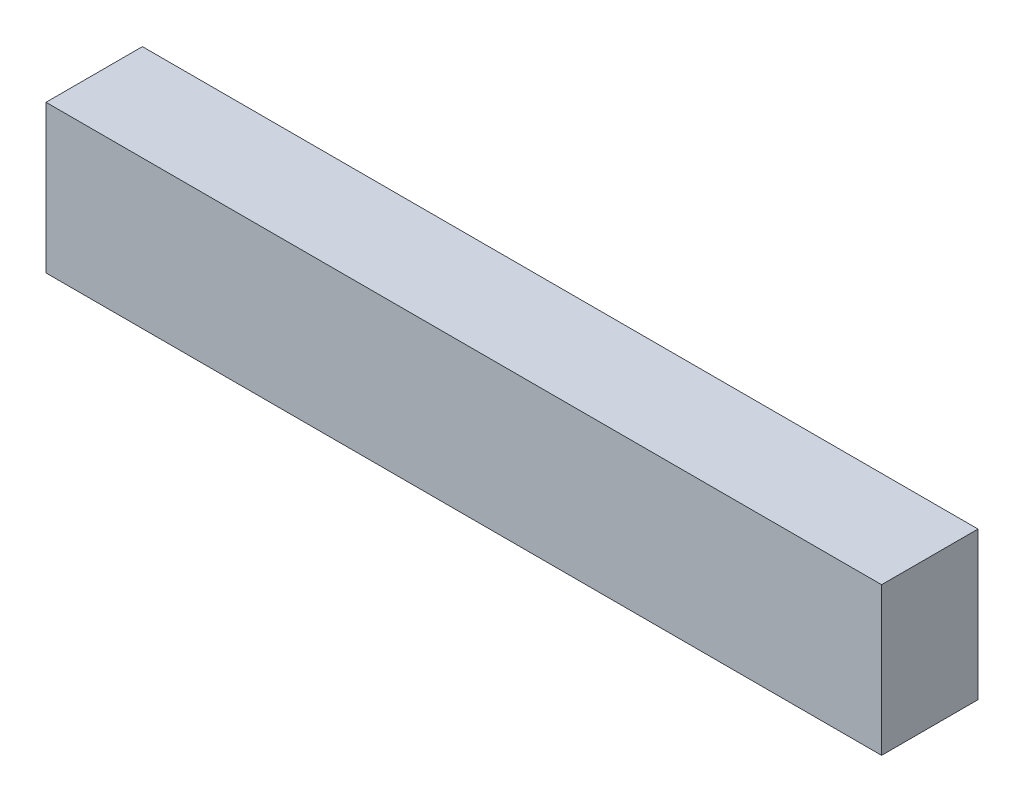
ISO-10303-21;
HEADER;
FILE_DESCRIPTION(('STEP AP214'),'2;1');
FILE_NAME('part.step','',(''),(''),'','','');
FILE_SCHEMA(('AUTOMOTIVE_DESIGN { 1 0 10303 214 1 1 1 1 }'));
ENDSEC;
DATA;
#1=APPLICATION_CONTEXT('core data for automotive mechanical design processes');
#2=APPLICATION_PROTOCOL_DEFINITION('international standard','automotive_design',2000,#1);
#3=PRODUCT_CONTEXT('',#1,'mechanical');
#4=PRODUCT('Part','Part','',(#3));
#5=PRODUCT_RELATED_PRODUCT_CATEGORY('part','',(#4));
#6=PRODUCT_DEFINITION_FORMATION('','',#4);
#7=PRODUCT_DEFINITION_CONTEXT('part definition',#1,'design');
#8=PRODUCT_DEFINITION('design','',#6,#7);
#9=PRODUCT_DEFINITION_SHAPE('','',#8);
#10=(LENGTH_UNIT() NAMED_UNIT(*) SI_UNIT(.MILLI.,.METRE.));
#11=(NAMED_UNIT(*) PLANE_ANGLE_UNIT() SI_UNIT($,.RADIAN.));
#12=(NAMED_UNIT(*) SI_UNIT($,.STERADIAN.) SOLID_ANGLE_UNIT());
#13=UNCERTAINTY_MEASURE_WITH_UNIT(LENGTH_MEASURE(1.E-05),#10,'distance_accuracy_value','');
#14=(GEOMETRIC_REPRESENTATION_CONTEXT(3) GLOBAL_UNCERTAINTY_ASSIGNED_CONTEXT((#13)) GLOBAL_UNIT_ASSIGNED_CONTEXT((#10,
#11,#12)) REPRESENTATION_CONTEXT('',''));
#15=CARTESIAN_POINT('',(0.,0.,0.));
#16=DIRECTION('',(0.,0.,1.));
#17=DIRECTION('',(1.,0.,0.));
#18=AXIS2_PLACEMENT_3D('',#15,#16,#17);
#19=CARTESIAN_POINT('',(65.,23.,7.5));
#20=DIRECTION('',(-1.,0.,0.));
#21=DIRECTION('',(0.,0.,1.));
#22=AXIS2_PLACEMENT_3D('',#19,#20,#21);
#23=PLANE('',#22);
#24=DIRECTION('',(0.,0.,-1.));
#25=VECTOR('',#24,1.);
#26=CARTESIAN_POINT('',(65.,0.,7.5));
#27=LINE('',#26,#25);
#28=CARTESIAN_POINT('',(65.,0.,7.5));
#29=VERTEX_POINT('',#28);
#30=CARTESIAN_POINT('',(65.,0.,-7.5));
#31=VERTEX_POINT('',#30);
#32=EDGE_CURVE('E98',#29,#31,#27,.T.);
#33=ORIENTED_EDGE('',*,*,#32,.T.);
#34=DIRECTION('',(0.,-1.,0.));
#35=VECTOR('',#34,1.);
#36=CARTESIAN_POINT('',(65.,23.,-7.5));
#37=LINE('',#36,#35);
#38=CARTESIAN_POINT('',(65.,23.,-7.5));
#39=VERTEX_POINT('',#38);
#40=EDGE_CURVE('E11',#39,#31,#37,.T.);
#41=ORIENTED_EDGE('',*,*,#40,.F.);
#42=DIRECTION('',(0.,0.,-1.));
#43=VECTOR('',#42,1.);
#44=CARTESIAN_POINT('',(65.,23.,7.5));
#45=LINE('',#44,#43);
#46=CARTESIAN_POINT('',(65.,23.,7.5));
#47=VERTEX_POINT('',#46);
#48=EDGE_CURVE('E86',#47,#39,#45,.T.);
#49=ORIENTED_EDGE('',*,*,#48,.F.);
#50=DIRECTION('',(0.,-1.,0.));
#51=VECTOR('',#50,1.);
#52=CARTESIAN_POINT('',(65.,23.,7.5));
#53=LINE('',#52,#51);
#54=EDGE_CURVE('E94',#47,#29,#53,.T.);
#55=ORIENTED_EDGE('',*,*,#54,.T.);
#56=EDGE_LOOP('',(#33,#41,#49,#55));
#57=FACE_BOUND('',#56,.T.);
#58=ADVANCED_FACE('F35',(#57),#23,.F.);
#59=CARTESIAN_POINT('',(-65.,23.,-7.5));
#60=DIRECTION('',(0.,0.,1.));
#61=DIRECTION('',(1.,0.,0.));
#62=AXIS2_PLACEMENT_3D('',#59,#60,#61);
#63=PLANE('',#62);
#64=DIRECTION('',(-1.,0.,0.));
#65=VECTOR('',#64,1.);
#66=CARTESIAN_POINT('',(-65.,0.,-7.5));
#67=LINE('',#66,#65);
#68=CARTESIAN_POINT('',(-65.,0.,-7.5));
#69=VERTEX_POINT('',#68);
#70=EDGE_CURVE('E90',#31,#69,#67,.T.);
#71=ORIENTED_EDGE('',*,*,#70,.T.);
#72=DIRECTION('',(0.,-1.,0.));
#73=VECTOR('',#72,1.);
#74=CARTESIAN_POINT('',(-65.,23.,-7.5));
#75=LINE('',#74,#73);
#76=CARTESIAN_POINT('',(-65.,23.,-7.5));
#77=VERTEX_POINT('',#76);
#78=EDGE_CURVE('E43',#77,#69,#75,.T.);
#79=ORIENTED_EDGE('',*,*,#78,.F.);
#80=DIRECTION('',(-1.,0.,0.));
#81=VECTOR('',#80,1.);
#82=CARTESIAN_POINT('',(-65.,23.,-7.5));
#83=LINE('',#82,#81);
#84=EDGE_CURVE('E81',#39,#77,#83,.T.);
#85=ORIENTED_EDGE('',*,*,#84,.F.);
#86=ORIENTED_EDGE('',*,*,#40,.T.);
#87=EDGE_LOOP('',(#71,#79,#85,#86));
#88=FACE_BOUND('',#87,.T.);
#89=ADVANCED_FACE('F89',(#88),#63,.F.);
#90=CARTESIAN_POINT('',(-65.,23.,7.5));
#91=DIRECTION('',(1.,0.,0.));
#92=DIRECTION('',(0.,0.,-1.));
#93=AXIS2_PLACEMENT_3D('',#90,#91,#92);
#94=PLANE('',#93);
#95=DIRECTION('',(0.,0.,1.));
#96=VECTOR('',#95,1.);
#97=CARTESIAN_POINT('',(-65.,0.,7.5));
#98=LINE('',#97,#96);
#99=CARTESIAN_POINT('',(-65.,0.,7.5));
#100=VERTEX_POINT('',#99);
#101=EDGE_CURVE('E68',#69,#100,#98,.T.);
#102=ORIENTED_EDGE('',*,*,#101,.T.);
#103=DIRECTION('',(0.,-1.,0.));
#104=VECTOR('',#103,1.);
#105=CARTESIAN_POINT('',(-65.,23.,7.5));
#106=LINE('',#105,#104);
#107=CARTESIAN_POINT('',(-65.,23.,7.5));
#108=VERTEX_POINT('',#107);
#109=EDGE_CURVE('E91',#108,#100,#106,.T.);
#110=ORIENTED_EDGE('',*,*,#109,.F.);
#111=DIRECTION('',(0.,0.,1.));
#112=VECTOR('',#111,1.);
#113=CARTESIAN_POINT('',(-65.,23.,7.5));
#114=LINE('',#113,#112);
#115=EDGE_CURVE('E84',#77,#108,#114,.T.);
#116=ORIENTED_EDGE('',*,*,#115,.F.);
#117=ORIENTED_EDGE('',*,*,#78,.T.);
#118=EDGE_LOOP('',(#102,#110,#116,#117));
#119=FACE_BOUND('',#118,.T.);
#120=ADVANCED_FACE('F92',(#119),#94,.F.);
#121=CARTESIAN_POINT('',(-65.,23.,7.5));
#122=DIRECTION('',(0.,0.,-1.));
#123=DIRECTION('',(-1.,0.,0.));
#124=AXIS2_PLACEMENT_3D('',#121,#122,#123);
#125=PLANE('',#124);
#126=DIRECTION('',(1.,0.,0.));
#127=VECTOR('',#126,1.);
#128=CARTESIAN_POINT('',(-65.,0.,7.5));
#129=LINE('',#128,#127);
#130=EDGE_CURVE('E74',#100,#29,#129,.T.);
#131=ORIENTED_EDGE('',*,*,#130,.T.);
#132=ORIENTED_EDGE('',*,*,#54,.F.);
#133=DIRECTION('',(1.,0.,0.));
#134=VECTOR('',#133,1.);
#135=CARTESIAN_POINT('',(-65.,23.,7.5));
#136=LINE('',#135,#134);
#137=EDGE_CURVE('E51',#108,#47,#136,.T.);
#138=ORIENTED_EDGE('',*,*,#137,.F.);
#139=ORIENTED_EDGE('',*,*,#109,.T.);
#140=EDGE_LOOP('',(#131,#132,#138,#139));
#141=FACE_BOUND('',#140,.T.);
#142=ADVANCED_FACE('F105',(#141),#125,.F.);
#143=CARTESIAN_POINT('',(0.,23.,0.));
#144=DIRECTION('',(0.,-1.,0.));
#145=DIRECTION('',(0.,0.,-1.));
#146=AXIS2_PLACEMENT_3D('',#143,#144,#145);
#147=PLANE('',#146);
#148=ORIENTED_EDGE('',*,*,#48,.T.);
#149=ORIENTED_EDGE('',*,*,#84,.T.);
#150=ORIENTED_EDGE('',*,*,#115,.T.);
#151=ORIENTED_EDGE('',*,*,#137,.T.);
#152=EDGE_LOOP('',(#148,#149,#150,#151));
#153=FACE_BOUND('',#152,.T.);
#154=ADVANCED_FACE('F82',(#153),#147,.F.);
#155=CARTESIAN_POINT('',(0.,0.,0.));
#156=DIRECTION('',(0.,-1.,0.));
#157=DIRECTION('',(0.,0.,-1.));
#158=AXIS2_PLACEMENT_3D('',#155,#156,#157);
#159=PLANE('',#158);
#160=ORIENTED_EDGE('',*,*,#32,.F.);
#161=ORIENTED_EDGE('',*,*,#130,.F.);
#162=ORIENTED_EDGE('',*,*,#101,.F.);
#163=ORIENTED_EDGE('',*,*,#70,.F.);
#164=EDGE_LOOP('',(#160,#161,#162,#163));
#165=FACE_BOUND('',#164,.T.);
#166=ADVANCED_FACE('F108',(#165),#159,.T.);
#167=CLOSED_SHELL('',(#58,#89,#120,#142,#154,#166));
#168=MANIFOLD_SOLID_BREP('B2',#167);
#169=ADVANCED_BREP_SHAPE_REPRESENTATION('',(#18,#168),#14);
#170=SHAPE_DEFINITION_REPRESENTATION(#9,#169);
ENDSEC;
END-ISO-10303-21;
